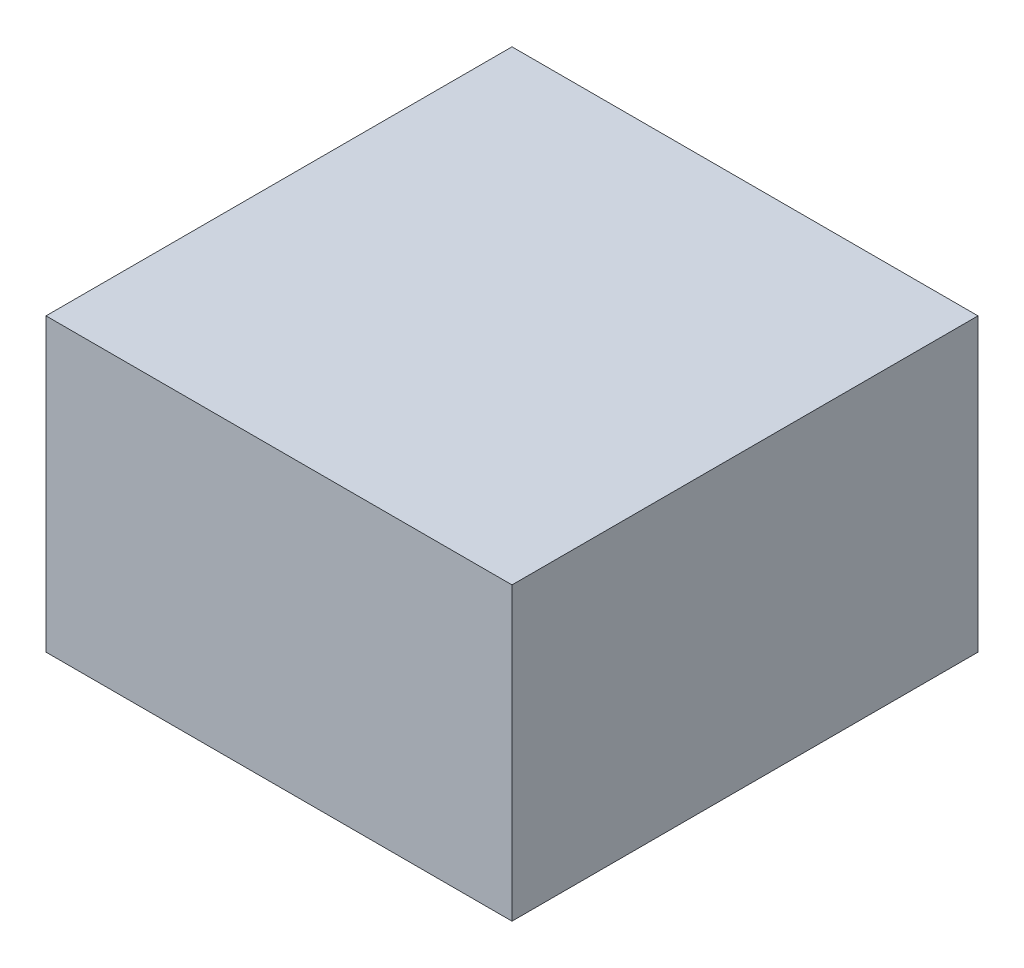
ISO-10303-21;
HEADER;
FILE_DESCRIPTION(('STEP AP214'),'2;1');
FILE_NAME('part.step','',(''),(''),'','','');
FILE_SCHEMA(('AUTOMOTIVE_DESIGN { 1 0 10303 214 1 1 1 1 }'));
ENDSEC;
DATA;
#1=APPLICATION_CONTEXT('core data for automotive mechanical design processes');
#2=APPLICATION_PROTOCOL_DEFINITION('international standard','automotive_design',2000,#1);
#3=PRODUCT_CONTEXT('',#1,'mechanical');
#4=PRODUCT('Part','Part','',(#3));
#5=PRODUCT_RELATED_PRODUCT_CATEGORY('part','',(#4));
#6=PRODUCT_DEFINITION_FORMATION('','',#4);
#7=PRODUCT_DEFINITION_CONTEXT('part definition',#1,'design');
#8=PRODUCT_DEFINITION('design','',#6,#7);
#9=PRODUCT_DEFINITION_SHAPE('','',#8);
#10=(LENGTH_UNIT() NAMED_UNIT(*) SI_UNIT(.MILLI.,.METRE.));
#11=(NAMED_UNIT(*) PLANE_ANGLE_UNIT() SI_UNIT($,.RADIAN.));
#12=(NAMED_UNIT(*) SI_UNIT($,.STERADIAN.) SOLID_ANGLE_UNIT());
#13=UNCERTAINTY_MEASURE_WITH_UNIT(LENGTH_MEASURE(1.E-05),#10,'distance_accuracy_value','');
#14=(GEOMETRIC_REPRESENTATION_CONTEXT(3) GLOBAL_UNCERTAINTY_ASSIGNED_CONTEXT((#13)) GLOBAL_UNIT_ASSIGNED_CONTEXT((#10,
#11,#12)) REPRESENTATION_CONTEXT('',''));
#15=CARTESIAN_POINT('',(0.,0.,0.));
#16=DIRECTION('',(0.,0.,1.));
#17=DIRECTION('',(1.,0.,0.));
#18=AXIS2_PLACEMENT_3D('',#15,#16,#17);
#19=CARTESIAN_POINT('',(-101.6,127.,101.6));
#20=DIRECTION('',(1.,0.,0.));
#21=DIRECTION('',(0.,0.,-1.));
#22=AXIS2_PLACEMENT_3D('',#19,#20,#21);
#23=PLANE('',#22);
#24=DIRECTION('',(0.,0.,1.));
#25=VECTOR('',#24,1.);
#26=CARTESIAN_POINT('',(-101.6,0.,101.6));
#27=LINE('',#26,#25);
#28=CARTESIAN_POINT('',(-101.6,0.,-101.6));
#29=VERTEX_POINT('',#28);
#30=CARTESIAN_POINT('',(-101.6,0.,101.6));
#31=VERTEX_POINT('',#30);
#32=EDGE_CURVE('E95',#29,#31,#27,.T.);
#33=ORIENTED_EDGE('',*,*,#32,.T.);
#34=DIRECTION('',(0.,-1.,0.));
#35=VECTOR('',#34,1.);
#36=CARTESIAN_POINT('',(-101.6,127.,101.6));
#37=LINE('',#36,#35);
#38=CARTESIAN_POINT('',(-101.6,127.,101.6));
#39=VERTEX_POINT('',#38);
#40=EDGE_CURVE('E11',#39,#31,#37,.T.);
#41=ORIENTED_EDGE('',*,*,#40,.F.);
#42=DIRECTION('',(0.,0.,1.));
#43=VECTOR('',#42,1.);
#44=CARTESIAN_POINT('',(-101.6,127.,101.6));
#45=LINE('',#44,#43);
#46=CARTESIAN_POINT('',(-101.6,127.,-101.6));
#47=VERTEX_POINT('',#46);
#48=EDGE_CURVE('E83',#47,#39,#45,.T.);
#49=ORIENTED_EDGE('',*,*,#48,.F.);
#50=DIRECTION('',(0.,-1.,0.));
#51=VECTOR('',#50,1.);
#52=CARTESIAN_POINT('',(-101.6,127.,-101.6));
#53=LINE('',#52,#51);
#54=EDGE_CURVE('E91',#47,#29,#53,.T.);
#55=ORIENTED_EDGE('',*,*,#54,.T.);
#56=EDGE_LOOP('',(#33,#41,#49,#55));
#57=FACE_BOUND('',#56,.T.);
#58=ADVANCED_FACE('F32',(#57),#23,.F.);
#59=CARTESIAN_POINT('',(101.6,127.,101.6));
#60=DIRECTION('',(0.,0.,-1.));
#61=DIRECTION('',(-1.,0.,0.));
#62=AXIS2_PLACEMENT_3D('',#59,#60,#61);
#63=PLANE('',#62);
#64=DIRECTION('',(1.,0.,0.));
#65=VECTOR('',#64,1.);
#66=CARTESIAN_POINT('',(101.6,0.,101.6));
#67=LINE('',#66,#65);
#68=CARTESIAN_POINT('',(101.6,0.,101.6));
#69=VERTEX_POINT('',#68);
#70=EDGE_CURVE('E87',#31,#69,#67,.T.);
#71=ORIENTED_EDGE('',*,*,#70,.T.);
#72=DIRECTION('',(0.,-1.,0.));
#73=VECTOR('',#72,1.);
#74=CARTESIAN_POINT('',(101.6,127.,101.6));
#75=LINE('',#74,#73);
#76=CARTESIAN_POINT('',(101.6,127.,101.6));
#77=VERTEX_POINT('',#76);
#78=EDGE_CURVE('E40',#77,#69,#75,.T.);
#79=ORIENTED_EDGE('',*,*,#78,.F.);
#80=DIRECTION('',(1.,0.,0.));
#81=VECTOR('',#80,1.);
#82=CARTESIAN_POINT('',(101.6,127.,101.6));
#83=LINE('',#82,#81);
#84=EDGE_CURVE('E78',#39,#77,#83,.T.);
#85=ORIENTED_EDGE('',*,*,#84,.F.);
#86=ORIENTED_EDGE('',*,*,#40,.T.);
#87=EDGE_LOOP('',(#71,#79,#85,#86));
#88=FACE_BOUND('',#87,.T.);
#89=ADVANCED_FACE('F86',(#88),#63,.F.);
#90=CARTESIAN_POINT('',(101.6,127.,101.6));
#91=DIRECTION('',(-1.,0.,0.));
#92=DIRECTION('',(0.,0.,1.));
#93=AXIS2_PLACEMENT_3D('',#90,#91,#92);
#94=PLANE('',#93);
#95=DIRECTION('',(0.,0.,-1.));
#96=VECTOR('',#95,1.);
#97=CARTESIAN_POINT('',(101.6,0.,101.6));
#98=LINE('',#97,#96);
#99=CARTESIAN_POINT('',(101.6,0.,-101.6));
#100=VERTEX_POINT('',#99);
#101=EDGE_CURVE('E65',#69,#100,#98,.T.);
#102=ORIENTED_EDGE('',*,*,#101,.T.);
#103=DIRECTION('',(0.,-1.,0.));
#104=VECTOR('',#103,1.);
#105=CARTESIAN_POINT('',(101.6,127.,-101.6));
#106=LINE('',#105,#104);
#107=CARTESIAN_POINT('',(101.6,127.,-101.6));
#108=VERTEX_POINT('',#107);
#109=EDGE_CURVE('E88',#108,#100,#106,.T.);
#110=ORIENTED_EDGE('',*,*,#109,.F.);
#111=DIRECTION('',(0.,0.,-1.));
#112=VECTOR('',#111,1.);
#113=CARTESIAN_POINT('',(101.6,127.,101.6));
#114=LINE('',#113,#112);
#115=EDGE_CURVE('E81',#77,#108,#114,.T.);
#116=ORIENTED_EDGE('',*,*,#115,.F.);
#117=ORIENTED_EDGE('',*,*,#78,.T.);
#118=EDGE_LOOP('',(#102,#110,#116,#117));
#119=FACE_BOUND('',#118,.T.);
#120=ADVANCED_FACE('F89',(#119),#94,.F.);
#121=CARTESIAN_POINT('',(101.6,127.,-101.6));
#122=DIRECTION('',(0.,0.,1.));
#123=DIRECTION('',(1.,0.,0.));
#124=AXIS2_PLACEMENT_3D('',#121,#122,#123);
#125=PLANE('',#124);
#126=DIRECTION('',(-1.,0.,0.));
#127=VECTOR('',#126,1.);
#128=CARTESIAN_POINT('',(101.6,0.,-101.6));
#129=LINE('',#128,#127);
#130=EDGE_CURVE('E71',#100,#29,#129,.T.);
#131=ORIENTED_EDGE('',*,*,#130,.T.);
#132=ORIENTED_EDGE('',*,*,#54,.F.);
#133=DIRECTION('',(-1.,0.,0.));
#134=VECTOR('',#133,1.);
#135=CARTESIAN_POINT('',(101.6,127.,-101.6));
#136=LINE('',#135,#134);
#137=EDGE_CURVE('E48',#108,#47,#136,.T.);
#138=ORIENTED_EDGE('',*,*,#137,.F.);
#139=ORIENTED_EDGE('',*,*,#109,.T.);
#140=EDGE_LOOP('',(#131,#132,#138,#139));
#141=FACE_BOUND('',#140,.T.);
#142=ADVANCED_FACE('F102',(#141),#125,.F.);
#143=CARTESIAN_POINT('',(0.,127.,0.));
#144=DIRECTION('',(0.,1.,0.));
#145=DIRECTION('',(0.,0.,1.));
#146=AXIS2_PLACEMENT_3D('',#143,#144,#145);
#147=PLANE('',#146);
#148=ORIENTED_EDGE('',*,*,#48,.T.);
#149=ORIENTED_EDGE('',*,*,#84,.T.);
#150=ORIENTED_EDGE('',*,*,#115,.T.);
#151=ORIENTED_EDGE('',*,*,#137,.T.);
#152=EDGE_LOOP('',(#148,#149,#150,#151));
#153=FACE_BOUND('',#152,.T.);
#154=ADVANCED_FACE('F79',(#153),#147,.T.);
#155=CARTESIAN_POINT('',(0.,0.,0.));
#156=DIRECTION('',(0.,1.,0.));
#157=DIRECTION('',(0.,0.,1.));
#158=AXIS2_PLACEMENT_3D('',#155,#156,#157);
#159=PLANE('',#158);
#160=ORIENTED_EDGE('',*,*,#32,.F.);
#161=ORIENTED_EDGE('',*,*,#130,.F.);
#162=ORIENTED_EDGE('',*,*,#101,.F.);
#163=ORIENTED_EDGE('',*,*,#70,.F.);
#164=EDGE_LOOP('',(#160,#161,#162,#163));
#165=FACE_BOUND('',#164,.T.);
#166=ADVANCED_FACE('F105',(#165),#159,.F.);
#167=CLOSED_SHELL('',(#58,#89,#120,#142,#154,#166));
#168=MANIFOLD_SOLID_BREP('B2',#167);
#169=ADVANCED_BREP_SHAPE_REPRESENTATION('',(#18,#168),#14);
#170=SHAPE_DEFINITION_REPRESENTATION(#9,#169);
ENDSEC;
END-ISO-10303-21;
